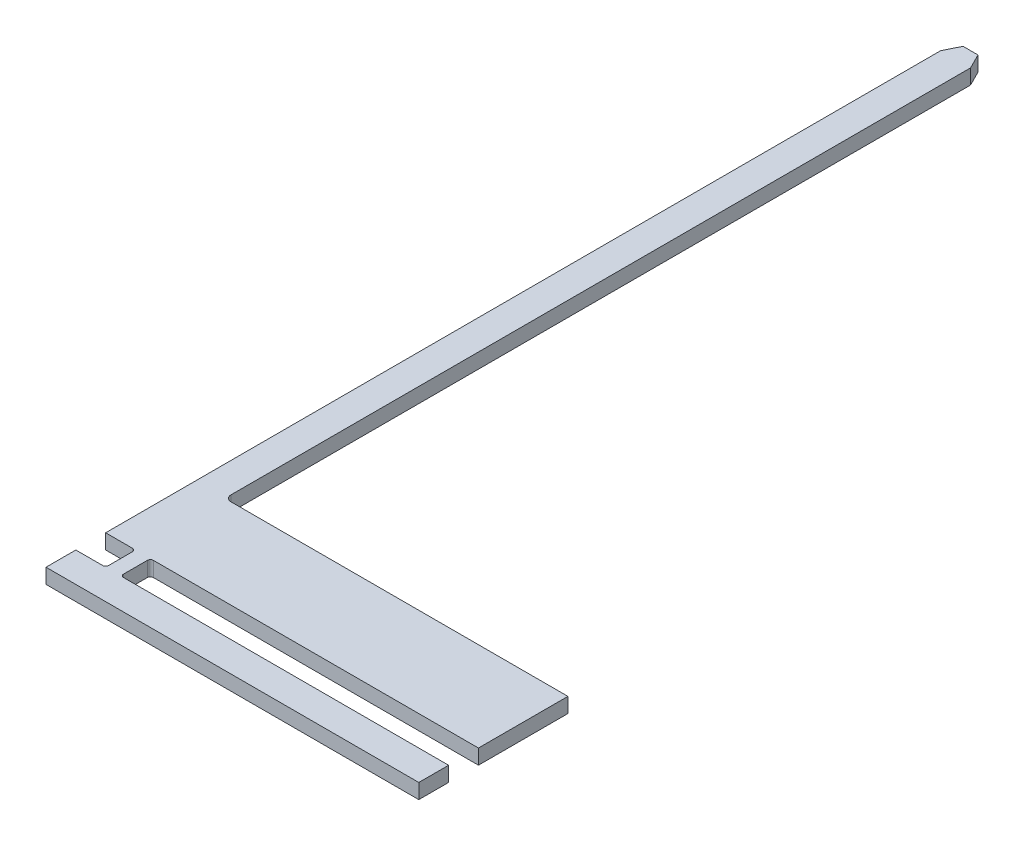
ISO-10303-21;
HEADER;
FILE_DESCRIPTION(('STEP AP214'),'2;1');
FILE_NAME('part.step','',(''),(''),'','','');
FILE_SCHEMA(('AUTOMOTIVE_DESIGN { 1 0 10303 214 1 1 1 1 }'));
ENDSEC;
DATA;
#1=APPLICATION_CONTEXT('core data for automotive mechanical design processes');
#2=APPLICATION_PROTOCOL_DEFINITION('international standard','automotive_design',2000,#1);
#3=PRODUCT_CONTEXT('',#1,'mechanical');
#4=PRODUCT('Part','Part','',(#3));
#5=PRODUCT_RELATED_PRODUCT_CATEGORY('part','',(#4));
#6=PRODUCT_DEFINITION_FORMATION('','',#4);
#7=PRODUCT_DEFINITION_CONTEXT('part definition',#1,'design');
#8=PRODUCT_DEFINITION('design','',#6,#7);
#9=PRODUCT_DEFINITION_SHAPE('','',#8);
#10=(LENGTH_UNIT() NAMED_UNIT(*) SI_UNIT(.MILLI.,.METRE.));
#11=(NAMED_UNIT(*) PLANE_ANGLE_UNIT() SI_UNIT($,.RADIAN.));
#12=(NAMED_UNIT(*) SI_UNIT($,.STERADIAN.) SOLID_ANGLE_UNIT());
#13=UNCERTAINTY_MEASURE_WITH_UNIT(LENGTH_MEASURE(1.E-05),#10,'distance_accuracy_value','');
#14=(GEOMETRIC_REPRESENTATION_CONTEXT(3) GLOBAL_UNCERTAINTY_ASSIGNED_CONTEXT((#13)) GLOBAL_UNIT_ASSIGNED_CONTEXT((#10,
#11,#12)) REPRESENTATION_CONTEXT('',''));
#15=CARTESIAN_POINT('',(0.,0.,0.));
#16=DIRECTION('',(0.,0.,1.));
#17=DIRECTION('',(1.,0.,0.));
#18=AXIS2_PLACEMENT_3D('',#15,#16,#17);
#19=CARTESIAN_POINT('',(0.0547920810387309,0.01,0.125212903225808));
#20=DIRECTION('',(-1.,0.,0.));
#21=DIRECTION('',(0.,0.,1.));
#22=AXIS2_PLACEMENT_3D('',#19,#20,#21);
#23=PLANE('',#22);
#24=DIRECTION('',(0.,0.,-1.));
#25=VECTOR('',#24,1.);
#26=CARTESIAN_POINT('',(0.0547920810387309,0.,0.125212903225808));
#27=LINE('',#26,#25);
#28=CARTESIAN_POINT('',(0.0547920810387309,0.,0.145212903225808));
#29=VERTEX_POINT('',#28);
#30=CARTESIAN_POINT('',(0.0547920810387309,0.,0.125212903225808));
#31=VERTEX_POINT('',#30);
#32=EDGE_CURVE('E230',#29,#31,#27,.T.);
#33=ORIENTED_EDGE('',*,*,#32,.T.);
#34=DIRECTION('',(0.,-1.,0.));
#35=VECTOR('',#34,1.);
#36=CARTESIAN_POINT('',(0.0547920810387309,0.01,0.125212903225808));
#37=LINE('',#36,#35);
#38=CARTESIAN_POINT('',(0.0547920810387309,0.01,0.125212903225808));
#39=VERTEX_POINT('',#38);
#40=EDGE_CURVE('E13',#39,#31,#37,.T.);
#41=ORIENTED_EDGE('',*,*,#40,.F.);
#42=DIRECTION('',(0.,0.,-1.));
#43=VECTOR('',#42,1.);
#44=CARTESIAN_POINT('',(0.0547920810387309,0.01,0.125212903225808));
#45=LINE('',#44,#43);
#46=CARTESIAN_POINT('',(0.0547920810387309,0.01,0.145212903225808));
#47=VERTEX_POINT('',#46);
#48=EDGE_CURVE('E292',#47,#39,#45,.T.);
#49=ORIENTED_EDGE('',*,*,#48,.F.);
#50=DIRECTION('',(0.,-1.,0.));
#51=VECTOR('',#50,1.);
#52=CARTESIAN_POINT('',(0.0547920810387309,0.01,0.145212903225808));
#53=LINE('',#52,#51);
#54=EDGE_CURVE('E226',#47,#29,#53,.T.);
#55=ORIENTED_EDGE('',*,*,#54,.T.);
#56=EDGE_LOOP('',(#33,#41,#49,#55));
#57=FACE_BOUND('',#56,.T.);
#58=ADVANCED_FACE('F51',(#57),#23,.F.);
#59=CARTESIAN_POINT('',(0.0547920810387309,0.01,0.125212903225808));
#60=DIRECTION('',(0.,0.,1.));
#61=DIRECTION('',(1.,0.,0.));
#62=AXIS2_PLACEMENT_3D('',#59,#60,#61);
#63=PLANE('',#62);
#64=DIRECTION('',(-1.,0.,0.));
#65=VECTOR('',#64,1.);
#66=CARTESIAN_POINT('',(0.0547920810387309,0.,0.125212903225808));
#67=LINE('',#66,#65);
#68=CARTESIAN_POINT('',(-0.163207918961269,0.,0.125212903225808));
#69=VERTEX_POINT('',#68);
#70=EDGE_CURVE('E234',#31,#69,#67,.T.);
#71=ORIENTED_EDGE('',*,*,#70,.T.);
#72=DIRECTION('',(0.,-1.,0.));
#73=VECTOR('',#72,1.);
#74=CARTESIAN_POINT('',(-0.163207918961269,0.01,0.125212903225808));
#75=LINE('',#74,#73);
#76=CARTESIAN_POINT('',(-0.163207918961269,0.01,0.125212903225808));
#77=VERTEX_POINT('',#76);
#78=EDGE_CURVE('E60',#77,#69,#75,.T.);
#79=ORIENTED_EDGE('',*,*,#78,.F.);
#80=DIRECTION('',(-1.,0.,0.));
#81=VECTOR('',#80,1.);
#82=CARTESIAN_POINT('',(0.0547920810387309,0.01,0.125212903225808));
#83=LINE('',#82,#81);
#84=EDGE_CURVE('E150',#39,#77,#83,.T.);
#85=ORIENTED_EDGE('',*,*,#84,.F.);
#86=ORIENTED_EDGE('',*,*,#40,.T.);
#87=EDGE_LOOP('',(#71,#79,#85,#86));
#88=FACE_BOUND('',#87,.T.);
#89=ADVANCED_FACE('F449',(#88),#63,.F.);
#90=CARTESIAN_POINT('',(-0.163207918961269,0.01,0.123212903225808));
#91=DIRECTION('',(0.,-1.,0.));
#92=DIRECTION('',(0.,0.,-1.));
#93=AXIS2_PLACEMENT_3D('',#90,#91,#92);
#94=CYLINDRICAL_SURFACE('',#93,0.00199999999999999);
#95=CARTESIAN_POINT('',(-0.163207918961269,0.,0.123212903225808));
#96=DIRECTION('',(0.,-1.,0.));
#97=DIRECTION('',(0.,0.,-1.));
#98=AXIS2_PLACEMENT_3D('',#95,#96,#97);
#99=CIRCLE('',#98,0.00199999999999999);
#100=CARTESIAN_POINT('',(-0.165207918961269,0.,0.123212903225808));
#101=VERTEX_POINT('',#100);
#102=EDGE_CURVE('E237',#69,#101,#99,.T.);
#103=ORIENTED_EDGE('',*,*,#102,.T.);
#104=DIRECTION('',(0.,-1.,0.));
#105=VECTOR('',#104,1.);
#106=CARTESIAN_POINT('',(-0.165207918961269,0.01,0.123212903225808));
#107=LINE('',#106,#105);
#108=CARTESIAN_POINT('',(-0.165207918961269,0.01,0.123212903225808));
#109=VERTEX_POINT('',#108);
#110=EDGE_CURVE('E355',#109,#101,#107,.T.);
#111=ORIENTED_EDGE('',*,*,#110,.F.);
#112=CARTESIAN_POINT('',(-0.163207918961269,0.01,0.123212903225808));
#113=DIRECTION('',(0.,-1.,0.));
#114=DIRECTION('',(0.,0.,-1.));
#115=AXIS2_PLACEMENT_3D('',#112,#113,#114);
#116=CIRCLE('',#115,0.00199999999999999);
#117=EDGE_CURVE('E365',#77,#109,#116,.T.);
#118=ORIENTED_EDGE('',*,*,#117,.F.);
#119=ORIENTED_EDGE('',*,*,#78,.T.);
#120=EDGE_LOOP('',(#103,#111,#118,#119));
#121=FACE_BOUND('',#120,.T.);
#122=ADVANCED_FACE('F363',(#121),#94,.F.);
#123=CARTESIAN_POINT('',(-0.165207918961269,0.01,0.123212903225808));
#124=DIRECTION('',(-1.,0.,0.));
#125=DIRECTION('',(0.,0.,1.));
#126=AXIS2_PLACEMENT_3D('',#123,#124,#125);
#127=PLANE('',#126);
#128=DIRECTION('',(0.,0.,-1.));
#129=VECTOR('',#128,1.);
#130=CARTESIAN_POINT('',(-0.165207918961269,0.,0.123212903225808));
#131=LINE('',#130,#129);
#132=CARTESIAN_POINT('',(-0.165207918961269,0.,0.107212903225808));
#133=VERTEX_POINT('',#132);
#134=EDGE_CURVE('E240',#101,#133,#131,.T.);
#135=ORIENTED_EDGE('',*,*,#134,.T.);
#136=DIRECTION('',(0.,-1.,0.));
#137=VECTOR('',#136,1.);
#138=CARTESIAN_POINT('',(-0.165207918961269,0.01,0.107212903225808));
#139=LINE('',#138,#137);
#140=CARTESIAN_POINT('',(-0.165207918961269,0.01,0.107212903225808));
#141=VERTEX_POINT('',#140);
#142=EDGE_CURVE('E351',#141,#133,#139,.T.);
#143=ORIENTED_EDGE('',*,*,#142,.F.);
#144=DIRECTION('',(0.,0.,-1.));
#145=VECTOR('',#144,1.);
#146=CARTESIAN_POINT('',(-0.165207918961269,0.01,0.123212903225808));
#147=LINE('',#146,#145);
#148=EDGE_CURVE('E384',#109,#141,#147,.T.);
#149=ORIENTED_EDGE('',*,*,#148,.F.);
#150=ORIENTED_EDGE('',*,*,#110,.T.);
#151=EDGE_LOOP('',(#135,#143,#149,#150));
#152=FACE_BOUND('',#151,.T.);
#153=ADVANCED_FACE('F374',(#152),#127,.F.);
#154=CARTESIAN_POINT('',(-0.163207918961269,0.01,0.107212903225808));
#155=DIRECTION('',(0.,-1.,0.));
#156=DIRECTION('',(0.,0.,-1.));
#157=AXIS2_PLACEMENT_3D('',#154,#155,#156);
#158=CYLINDRICAL_SURFACE('',#157,0.00199999999999999);
#159=CARTESIAN_POINT('',(-0.163207918961269,0.,0.107212903225808));
#160=DIRECTION('',(0.,-1.,0.));
#161=DIRECTION('',(0.,0.,1.));
#162=AXIS2_PLACEMENT_3D('',#159,#160,#161);
#163=CIRCLE('',#162,0.00199999999999999);
#164=CARTESIAN_POINT('',(-0.163207918961269,0.,0.105212903225808));
#165=VERTEX_POINT('',#164);
#166=EDGE_CURVE('E243',#133,#165,#163,.T.);
#167=ORIENTED_EDGE('',*,*,#166,.T.);
#168=DIRECTION('',(0.,-1.,0.));
#169=VECTOR('',#168,1.);
#170=CARTESIAN_POINT('',(-0.163207918961269,0.01,0.105212903225808));
#171=LINE('',#170,#169);
#172=CARTESIAN_POINT('',(-0.163207918961269,0.01,0.105212903225808));
#173=VERTEX_POINT('',#172);
#174=EDGE_CURVE('E347',#173,#165,#171,.T.);
#175=ORIENTED_EDGE('',*,*,#174,.F.);
#176=CARTESIAN_POINT('',(-0.163207918961269,0.01,0.107212903225808));
#177=DIRECTION('',(0.,-1.,0.));
#178=DIRECTION('',(0.,0.,1.));
#179=AXIS2_PLACEMENT_3D('',#176,#177,#178);
#180=CIRCLE('',#179,0.00199999999999999);
#181=EDGE_CURVE('E380',#141,#173,#180,.T.);
#182=ORIENTED_EDGE('',*,*,#181,.F.);
#183=ORIENTED_EDGE('',*,*,#142,.T.);
#184=EDGE_LOOP('',(#167,#175,#182,#183));
#185=FACE_BOUND('',#184,.T.);
#186=ADVANCED_FACE('F378',(#185),#158,.F.);
#187=CARTESIAN_POINT('',(-0.163207918961269,0.01,0.105212903225808));
#188=DIRECTION('',(0.,0.,-1.));
#189=DIRECTION('',(-1.,0.,0.));
#190=AXIS2_PLACEMENT_3D('',#187,#188,#189);
#191=PLANE('',#190);
#192=DIRECTION('',(1.,0.,0.));
#193=VECTOR('',#192,1.);
#194=CARTESIAN_POINT('',(-0.163207918961269,0.,0.105212903225808));
#195=LINE('',#194,#193);
#196=CARTESIAN_POINT('',(0.0547920810387309,0.,0.105212903225808));
#197=VERTEX_POINT('',#196);
#198=EDGE_CURVE('E246',#165,#197,#195,.T.);
#199=ORIENTED_EDGE('',*,*,#198,.T.);
#200=DIRECTION('',(0.,-1.,0.));
#201=VECTOR('',#200,1.);
#202=CARTESIAN_POINT('',(0.0547920810387309,0.01,0.105212903225808));
#203=LINE('',#202,#201);
#204=CARTESIAN_POINT('',(0.0547920810387309,0.01,0.105212903225808));
#205=VERTEX_POINT('',#204);
#206=EDGE_CURVE('E343',#205,#197,#203,.T.);
#207=ORIENTED_EDGE('',*,*,#206,.F.);
#208=DIRECTION('',(1.,0.,0.));
#209=VECTOR('',#208,1.);
#210=CARTESIAN_POINT('',(-0.163207918961269,0.01,0.105212903225808));
#211=LINE('',#210,#209);
#212=EDGE_CURVE('E383',#173,#205,#211,.T.);
#213=ORIENTED_EDGE('',*,*,#212,.F.);
#214=ORIENTED_EDGE('',*,*,#174,.T.);
#215=EDGE_LOOP('',(#199,#207,#213,#214));
#216=FACE_BOUND('',#215,.T.);
#217=ADVANCED_FACE('F462',(#216),#191,.F.);
#218=CARTESIAN_POINT('',(0.0547920810387309,0.01,0.0452129032258077));
#219=DIRECTION('',(-1.,0.,0.));
#220=DIRECTION('',(0.,0.,1.));
#221=AXIS2_PLACEMENT_3D('',#218,#219,#220);
#222=PLANE('',#221);
#223=DIRECTION('',(0.,0.,-1.));
#224=VECTOR('',#223,1.);
#225=CARTESIAN_POINT('',(0.0547920810387309,0.,0.0452129032258077));
#226=LINE('',#225,#224);
#227=CARTESIAN_POINT('',(0.0547920810387309,0.,0.0452129032258077));
#228=VERTEX_POINT('',#227);
#229=EDGE_CURVE('E249',#197,#228,#226,.T.);
#230=ORIENTED_EDGE('',*,*,#229,.T.);
#231=DIRECTION('',(0.,-1.,0.));
#232=VECTOR('',#231,1.);
#233=CARTESIAN_POINT('',(0.0547920810387309,0.01,0.0452129032258077));
#234=LINE('',#233,#232);
#235=CARTESIAN_POINT('',(0.0547920810387309,0.01,0.0452129032258077));
#236=VERTEX_POINT('',#235);
#237=EDGE_CURVE('E339',#236,#228,#234,.T.);
#238=ORIENTED_EDGE('',*,*,#237,.F.);
#239=DIRECTION('',(0.,0.,-1.));
#240=VECTOR('',#239,1.);
#241=CARTESIAN_POINT('',(0.0547920810387309,0.01,0.0452129032258077));
#242=LINE('',#241,#240);
#243=EDGE_CURVE('E388',#205,#236,#242,.T.);
#244=ORIENTED_EDGE('',*,*,#243,.F.);
#245=ORIENTED_EDGE('',*,*,#206,.T.);
#246=EDGE_LOOP('',(#230,#238,#244,#245));
#247=FACE_BOUND('',#246,.T.);
#248=ADVANCED_FACE('F465',(#247),#222,.F.);
#249=CARTESIAN_POINT('',(-0.171207918961269,0.01,0.0452129032258077));
#250=DIRECTION('',(0.,0.,1.));
#251=DIRECTION('',(1.,0.,0.));
#252=AXIS2_PLACEMENT_3D('',#249,#250,#251);
#253=PLANE('',#252);
#254=DIRECTION('',(-1.,0.,0.));
#255=VECTOR('',#254,1.);
#256=CARTESIAN_POINT('',(-0.171207918961269,0.,0.0452129032258077));
#257=LINE('',#256,#255);
#258=CARTESIAN_POINT('',(-0.171207918961269,0.,0.0452129032258077));
#259=VERTEX_POINT('',#258);
#260=EDGE_CURVE('E252',#228,#259,#257,.T.);
#261=ORIENTED_EDGE('',*,*,#260,.T.);
#262=DIRECTION('',(0.,-1.,0.));
#263=VECTOR('',#262,1.);
#264=CARTESIAN_POINT('',(-0.171207918961269,0.01,0.0452129032258077));
#265=LINE('',#264,#263);
#266=CARTESIAN_POINT('',(-0.171207918961269,0.01,0.0452129032258077));
#267=VERTEX_POINT('',#266);
#268=EDGE_CURVE('E335',#267,#259,#265,.T.);
#269=ORIENTED_EDGE('',*,*,#268,.F.);
#270=DIRECTION('',(-1.,0.,0.));
#271=VECTOR('',#270,1.);
#272=CARTESIAN_POINT('',(-0.171207918961269,0.01,0.0452129032258077));
#273=LINE('',#272,#271);
#274=EDGE_CURVE('E395',#236,#267,#273,.T.);
#275=ORIENTED_EDGE('',*,*,#274,.F.);
#276=ORIENTED_EDGE('',*,*,#237,.T.);
#277=EDGE_LOOP('',(#261,#269,#275,#276));
#278=FACE_BOUND('',#277,.T.);
#279=ADVANCED_FACE('F469',(#278),#253,.F.);
#280=CARTESIAN_POINT('',(-0.171207918961269,0.01,0.0412129032258077));
#281=DIRECTION('',(0.,-1.,0.));
#282=DIRECTION('',(0.,0.,-1.));
#283=AXIS2_PLACEMENT_3D('',#280,#281,#282);
#284=CYLINDRICAL_SURFACE('',#283,0.004);
#285=CARTESIAN_POINT('',(-0.171207918961269,0.,0.0412129032258077));
#286=DIRECTION('',(0.,-1.,0.));
#287=DIRECTION('',(0.,0.,-1.));
#288=AXIS2_PLACEMENT_3D('',#285,#286,#287);
#289=CIRCLE('',#288,0.004);
#290=CARTESIAN_POINT('',(-0.175207918961269,0.,0.0412129032258077));
#291=VERTEX_POINT('',#290);
#292=EDGE_CURVE('E255',#259,#291,#289,.T.);
#293=ORIENTED_EDGE('',*,*,#292,.T.);
#294=DIRECTION('',(0.,-1.,0.));
#295=VECTOR('',#294,1.);
#296=CARTESIAN_POINT('',(-0.175207918961269,0.01,0.0412129032258077));
#297=LINE('',#296,#295);
#298=CARTESIAN_POINT('',(-0.175207918961269,0.01,0.0412129032258077));
#299=VERTEX_POINT('',#298);
#300=EDGE_CURVE('E331',#299,#291,#297,.T.);
#301=ORIENTED_EDGE('',*,*,#300,.F.);
#302=CARTESIAN_POINT('',(-0.171207918961269,0.01,0.0412129032258077));
#303=DIRECTION('',(0.,-1.,0.));
#304=DIRECTION('',(0.,0.,-1.));
#305=AXIS2_PLACEMENT_3D('',#302,#303,#304);
#306=CIRCLE('',#305,0.004);
#307=EDGE_CURVE('E398',#267,#299,#306,.T.);
#308=ORIENTED_EDGE('',*,*,#307,.F.);
#309=ORIENTED_EDGE('',*,*,#268,.T.);
#310=EDGE_LOOP('',(#293,#301,#308,#309));
#311=FACE_BOUND('',#310,.T.);
#312=ADVANCED_FACE('F473',(#311),#284,.F.);
#313=CARTESIAN_POINT('',(-0.175207918961269,0.01,0.0412129032258077));
#314=DIRECTION('',(-1.,0.,0.));
#315=DIRECTION('',(0.,0.,1.));
#316=AXIS2_PLACEMENT_3D('',#313,#314,#315);
#317=PLANE('',#316);
#318=DIRECTION('',(0.,0.,-1.));
#319=VECTOR('',#318,1.);
#320=CARTESIAN_POINT('',(-0.175207918961269,0.,0.0412129032258077));
#321=LINE('',#320,#319);
#322=CARTESIAN_POINT('',(-0.175207918961269,0.,-0.454787096774192));
#323=VERTEX_POINT('',#322);
#324=EDGE_CURVE('E258',#291,#323,#321,.T.);
#325=ORIENTED_EDGE('',*,*,#324,.T.);
#326=DIRECTION('',(0.,-1.,0.));
#327=VECTOR('',#326,1.);
#328=CARTESIAN_POINT('',(-0.175207918961269,0.01,-0.454787096774192));
#329=LINE('',#328,#327);
#330=CARTESIAN_POINT('',(-0.175207918961269,0.01,-0.454787096774192));
#331=VERTEX_POINT('',#330);
#332=EDGE_CURVE('E327',#331,#323,#329,.T.);
#333=ORIENTED_EDGE('',*,*,#332,.F.);
#334=DIRECTION('',(0.,0.,-1.));
#335=VECTOR('',#334,1.);
#336=CARTESIAN_POINT('',(-0.175207918961269,0.01,0.0412129032258077));
#337=LINE('',#336,#335);
#338=EDGE_CURVE('E401',#299,#331,#337,.T.);
#339=ORIENTED_EDGE('',*,*,#338,.F.);
#340=ORIENTED_EDGE('',*,*,#300,.T.);
#341=EDGE_LOOP('',(#325,#333,#339,#340));
#342=FACE_BOUND('',#341,.T.);
#343=ADVANCED_FACE('F477',(#342),#317,.F.);
#344=CARTESIAN_POINT('',(-0.175207918961269,0.01,-0.454787096774192));
#345=DIRECTION('',(-0.894427190999915,0.,0.44721359549996));
#346=DIRECTION('',(0.44721359549996,0.,0.894427190999915));
#347=AXIS2_PLACEMENT_3D('',#344,#345,#346);
#348=PLANE('',#347);
#349=DIRECTION('',(-0.44721359549996,0.,-0.894427190999915));
#350=VECTOR('',#349,1.);
#351=CARTESIAN_POINT('',(-0.175207918961269,0.,-0.454787096774192));
#352=LINE('',#351,#350);
#353=CARTESIAN_POINT('',(-0.180207918961269,0.,-0.464787096774192));
#354=VERTEX_POINT('',#353);
#355=EDGE_CURVE('E261',#323,#354,#352,.T.);
#356=ORIENTED_EDGE('',*,*,#355,.T.);
#357=DIRECTION('',(0.,-1.,0.));
#358=VECTOR('',#357,1.);
#359=CARTESIAN_POINT('',(-0.180207918961269,0.01,-0.464787096774192));
#360=LINE('',#359,#358);
#361=CARTESIAN_POINT('',(-0.180207918961269,0.01,-0.464787096774192));
#362=VERTEX_POINT('',#361);
#363=EDGE_CURVE('E323',#362,#354,#360,.T.);
#364=ORIENTED_EDGE('',*,*,#363,.F.);
#365=DIRECTION('',(-0.44721359549996,0.,-0.894427190999915));
#366=VECTOR('',#365,1.);
#367=CARTESIAN_POINT('',(-0.175207918961269,0.01,-0.454787096774192));
#368=LINE('',#367,#366);
#369=EDGE_CURVE('E404',#331,#362,#368,.T.);
#370=ORIENTED_EDGE('',*,*,#369,.F.);
#371=ORIENTED_EDGE('',*,*,#332,.T.);
#372=EDGE_LOOP('',(#356,#364,#370,#371));
#373=FACE_BOUND('',#372,.T.);
#374=ADVANCED_FACE('F481',(#373),#348,.F.);
#375=CARTESIAN_POINT('',(-0.180207918961269,0.01,-0.464787096774192));
#376=DIRECTION('',(0.,0.,1.));
#377=DIRECTION('',(1.,0.,0.));
#378=AXIS2_PLACEMENT_3D('',#375,#376,#377);
#379=PLANE('',#378);
#380=DIRECTION('',(-1.,0.,0.));
#381=VECTOR('',#380,1.);
#382=CARTESIAN_POINT('',(-0.180207918961269,0.,-0.464787096774192));
#383=LINE('',#382,#381);
#384=CARTESIAN_POINT('',(-0.190207918961269,0.,-0.464787096774192));
#385=VERTEX_POINT('',#384);
#386=EDGE_CURVE('E264',#354,#385,#383,.T.);
#387=ORIENTED_EDGE('',*,*,#386,.T.);
#388=DIRECTION('',(0.,-1.,0.));
#389=VECTOR('',#388,1.);
#390=CARTESIAN_POINT('',(-0.190207918961269,0.01,-0.464787096774192));
#391=LINE('',#390,#389);
#392=CARTESIAN_POINT('',(-0.190207918961269,0.01,-0.464787096774192));
#393=VERTEX_POINT('',#392);
#394=EDGE_CURVE('E319',#393,#385,#391,.T.);
#395=ORIENTED_EDGE('',*,*,#394,.F.);
#396=DIRECTION('',(-1.,0.,0.));
#397=VECTOR('',#396,1.);
#398=CARTESIAN_POINT('',(-0.180207918961269,0.01,-0.464787096774192));
#399=LINE('',#398,#397);
#400=EDGE_CURVE('E407',#362,#393,#399,.T.);
#401=ORIENTED_EDGE('',*,*,#400,.F.);
#402=ORIENTED_EDGE('',*,*,#363,.T.);
#403=EDGE_LOOP('',(#387,#395,#401,#402));
#404=FACE_BOUND('',#403,.T.);
#405=ADVANCED_FACE('F485',(#404),#379,.F.);
#406=CARTESIAN_POINT('',(-0.190207918961269,0.01,-0.464787096774192));
#407=DIRECTION('',(0.894427190999916,0.,0.447213595499958));
#408=DIRECTION('',(0.447213595499958,0.,-0.894427190999916));
#409=AXIS2_PLACEMENT_3D('',#406,#407,#408);
#410=PLANE('',#409);
#411=DIRECTION('',(-0.447213595499958,0.,0.894427190999916));
#412=VECTOR('',#411,1.);
#413=CARTESIAN_POINT('',(-0.190207918961269,0.,-0.464787096774192));
#414=LINE('',#413,#412);
#415=CARTESIAN_POINT('',(-0.195207918961269,0.,-0.454787096774192));
#416=VERTEX_POINT('',#415);
#417=EDGE_CURVE('E267',#385,#416,#414,.T.);
#418=ORIENTED_EDGE('',*,*,#417,.T.);
#419=DIRECTION('',(0.,-1.,0.));
#420=VECTOR('',#419,1.);
#421=CARTESIAN_POINT('',(-0.195207918961269,0.01,-0.454787096774192));
#422=LINE('',#421,#420);
#423=CARTESIAN_POINT('',(-0.195207918961269,0.01,-0.454787096774192));
#424=VERTEX_POINT('',#423);
#425=EDGE_CURVE('E315',#424,#416,#422,.T.);
#426=ORIENTED_EDGE('',*,*,#425,.F.);
#427=DIRECTION('',(-0.447213595499958,0.,0.894427190999916));
#428=VECTOR('',#427,1.);
#429=CARTESIAN_POINT('',(-0.190207918961269,0.01,-0.464787096774192));
#430=LINE('',#429,#428);
#431=EDGE_CURVE('E410',#393,#424,#430,.T.);
#432=ORIENTED_EDGE('',*,*,#431,.F.);
#433=ORIENTED_EDGE('',*,*,#394,.T.);
#434=EDGE_LOOP('',(#418,#426,#432,#433));
#435=FACE_BOUND('',#434,.T.);
#436=ADVANCED_FACE('F489',(#435),#410,.F.);
#437=CARTESIAN_POINT('',(-0.195207918961269,0.01,0.0652129032258077));
#438=DIRECTION('',(1.,0.,0.));
#439=DIRECTION('',(0.,0.,-1.));
#440=AXIS2_PLACEMENT_3D('',#437,#438,#439);
#441=PLANE('',#440);
#442=DIRECTION('',(0.,0.,1.));
#443=VECTOR('',#442,1.);
#444=CARTESIAN_POINT('',(-0.195207918961269,0.,0.0652129032258077));
#445=LINE('',#444,#443);
#446=CARTESIAN_POINT('',(-0.195207918961269,0.,0.105212903225808));
#447=VERTEX_POINT('',#446);
#448=EDGE_CURVE('E271',#416,#447,#445,.T.);
#449=ORIENTED_EDGE('',*,*,#448,.T.);
#450=DIRECTION('',(0.,-1.,0.));
#451=VECTOR('',#450,1.);
#452=CARTESIAN_POINT('',(-0.195207918961269,0.01,0.105212903225808));
#453=LINE('',#452,#451);
#454=CARTESIAN_POINT('',(-0.195207918961269,0.01,0.105212903225808));
#455=VERTEX_POINT('',#454);
#456=EDGE_CURVE('E311',#455,#447,#453,.T.);
#457=ORIENTED_EDGE('',*,*,#456,.F.);
#458=DIRECTION('',(0.,0.,1.));
#459=VECTOR('',#458,1.);
#460=CARTESIAN_POINT('',(-0.195207918961269,0.01,0.0652129032258077));
#461=LINE('',#460,#459);
#462=EDGE_CURVE('E413',#424,#455,#461,.T.);
#463=ORIENTED_EDGE('',*,*,#462,.F.);
#464=ORIENTED_EDGE('',*,*,#425,.T.);
#465=EDGE_LOOP('',(#449,#457,#463,#464));
#466=FACE_BOUND('',#465,.T.);
#467=ADVANCED_FACE('F493',(#466),#441,.F.);
#468=CARTESIAN_POINT('',(-0.195207918961269,0.01,0.105212903225808));
#469=DIRECTION('',(0.,0.,-1.));
#470=DIRECTION('',(-1.,0.,0.));
#471=AXIS2_PLACEMENT_3D('',#468,#469,#470);
#472=PLANE('',#471);
#473=DIRECTION('',(1.,0.,0.));
#474=VECTOR('',#473,1.);
#475=CARTESIAN_POINT('',(-0.195207918961269,0.,0.105212903225808));
#476=LINE('',#475,#474);
#477=CARTESIAN_POINT('',(-0.177207918961269,0.,0.105212903225808));
#478=VERTEX_POINT('',#477);
#479=EDGE_CURVE('E274',#447,#478,#476,.T.);
#480=ORIENTED_EDGE('',*,*,#479,.T.);
#481=DIRECTION('',(0.,-1.,0.));
#482=VECTOR('',#481,1.);
#483=CARTESIAN_POINT('',(-0.177207918961269,0.01,0.105212903225808));
#484=LINE('',#483,#482);
#485=CARTESIAN_POINT('',(-0.177207918961269,0.01,0.105212903225808));
#486=VERTEX_POINT('',#485);
#487=EDGE_CURVE('E307',#486,#478,#484,.T.);
#488=ORIENTED_EDGE('',*,*,#487,.F.);
#489=DIRECTION('',(1.,0.,0.));
#490=VECTOR('',#489,1.);
#491=CARTESIAN_POINT('',(-0.195207918961269,0.01,0.105212903225808));
#492=LINE('',#491,#490);
#493=EDGE_CURVE('E416',#455,#486,#492,.T.);
#494=ORIENTED_EDGE('',*,*,#493,.F.);
#495=ORIENTED_EDGE('',*,*,#456,.T.);
#496=EDGE_LOOP('',(#480,#488,#494,#495));
#497=FACE_BOUND('',#496,.T.);
#498=ADVANCED_FACE('F497',(#497),#472,.F.);
#499=CARTESIAN_POINT('',(-0.177207918961269,0.01,0.107212903225808));
#500=DIRECTION('',(0.,-1.,0.));
#501=DIRECTION('',(0.,0.,-1.));
#502=AXIS2_PLACEMENT_3D('',#499,#500,#501);
#503=CYLINDRICAL_SURFACE('',#502,0.00199999999999999);
#504=CARTESIAN_POINT('',(-0.177207918961269,0.,0.107212903225808));
#505=DIRECTION('',(0.,-1.,0.));
#506=DIRECTION('',(0.,0.,-1.));
#507=AXIS2_PLACEMENT_3D('',#504,#505,#506);
#508=CIRCLE('',#507,0.00199999999999999);
#509=CARTESIAN_POINT('',(-0.175207918961269,0.,0.107212903225808));
#510=VERTEX_POINT('',#509);
#511=EDGE_CURVE('E277',#478,#510,#508,.T.);
#512=ORIENTED_EDGE('',*,*,#511,.T.);
#513=DIRECTION('',(0.,-1.,0.));
#514=VECTOR('',#513,1.);
#515=CARTESIAN_POINT('',(-0.175207918961269,0.01,0.107212903225808));
#516=LINE('',#515,#514);
#517=CARTESIAN_POINT('',(-0.175207918961269,0.01,0.107212903225808));
#518=VERTEX_POINT('',#517);
#519=EDGE_CURVE('E303',#518,#510,#516,.T.);
#520=ORIENTED_EDGE('',*,*,#519,.F.);
#521=CARTESIAN_POINT('',(-0.177207918961269,0.01,0.107212903225808));
#522=DIRECTION('',(0.,-1.,0.));
#523=DIRECTION('',(0.,0.,-1.));
#524=AXIS2_PLACEMENT_3D('',#521,#522,#523);
#525=CIRCLE('',#524,0.00199999999999999);
#526=EDGE_CURVE('E419',#486,#518,#525,.T.);
#527=ORIENTED_EDGE('',*,*,#526,.F.);
#528=ORIENTED_EDGE('',*,*,#487,.T.);
#529=EDGE_LOOP('',(#512,#520,#527,#528));
#530=FACE_BOUND('',#529,.T.);
#531=ADVANCED_FACE('F501',(#530),#503,.F.);
#532=CARTESIAN_POINT('',(-0.175207918961269,0.01,0.123212903225808));
#533=DIRECTION('',(1.,0.,0.));
#534=DIRECTION('',(0.,0.,-1.));
#535=AXIS2_PLACEMENT_3D('',#532,#533,#534);
#536=PLANE('',#535);
#537=DIRECTION('',(0.,0.,1.));
#538=VECTOR('',#537,1.);
#539=CARTESIAN_POINT('',(-0.175207918961269,0.,0.123212903225808));
#540=LINE('',#539,#538);
#541=CARTESIAN_POINT('',(-0.175207918961269,0.,0.123212903225808));
#542=VERTEX_POINT('',#541);
#543=EDGE_CURVE('E280',#510,#542,#540,.T.);
#544=ORIENTED_EDGE('',*,*,#543,.T.);
#545=DIRECTION('',(0.,-1.,0.));
#546=VECTOR('',#545,1.);
#547=CARTESIAN_POINT('',(-0.175207918961269,0.01,0.123212903225808));
#548=LINE('',#547,#546);
#549=CARTESIAN_POINT('',(-0.175207918961269,0.01,0.123212903225808));
#550=VERTEX_POINT('',#549);
#551=EDGE_CURVE('E299',#550,#542,#548,.T.);
#552=ORIENTED_EDGE('',*,*,#551,.F.);
#553=DIRECTION('',(0.,0.,1.));
#554=VECTOR('',#553,1.);
#555=CARTESIAN_POINT('',(-0.175207918961269,0.01,0.123212903225808));
#556=LINE('',#555,#554);
#557=EDGE_CURVE('E422',#518,#550,#556,.T.);
#558=ORIENTED_EDGE('',*,*,#557,.F.);
#559=ORIENTED_EDGE('',*,*,#519,.T.);
#560=EDGE_LOOP('',(#544,#552,#558,#559));
#561=FACE_BOUND('',#560,.T.);
#562=ADVANCED_FACE('F430',(#561),#536,.F.);
#563=CARTESIAN_POINT('',(-0.177207918961269,0.01,0.123212903225808));
#564=DIRECTION('',(0.,-1.,0.));
#565=DIRECTION('',(0.,0.,-1.));
#566=AXIS2_PLACEMENT_3D('',#563,#564,#565);
#567=CYLINDRICAL_SURFACE('',#566,0.00199999999999999);
#568=CARTESIAN_POINT('',(-0.177207918961269,0.,0.123212903225808));
#569=DIRECTION('',(0.,-1.,0.));
#570=DIRECTION('',(0.,0.,1.));
#571=AXIS2_PLACEMENT_3D('',#568,#569,#570);
#572=CIRCLE('',#571,0.00199999999999999);
#573=CARTESIAN_POINT('',(-0.177207918961269,0.,0.125212903225808));
#574=VERTEX_POINT('',#573);
#575=EDGE_CURVE('E283',#542,#574,#572,.T.);
#576=ORIENTED_EDGE('',*,*,#575,.T.);
#577=DIRECTION('',(0.,-1.,0.));
#578=VECTOR('',#577,1.);
#579=CARTESIAN_POINT('',(-0.177207918961269,0.01,0.125212903225808));
#580=LINE('',#579,#578);
#581=CARTESIAN_POINT('',(-0.177207918961269,0.01,0.125212903225808));
#582=VERTEX_POINT('',#581);
#583=EDGE_CURVE('E219',#582,#574,#580,.T.);
#584=ORIENTED_EDGE('',*,*,#583,.F.);
#585=CARTESIAN_POINT('',(-0.177207918961269,0.01,0.123212903225808));
#586=DIRECTION('',(0.,-1.,0.));
#587=DIRECTION('',(0.,0.,1.));
#588=AXIS2_PLACEMENT_3D('',#585,#586,#587);
#589=CIRCLE('',#588,0.00199999999999999);
#590=EDGE_CURVE('E208',#550,#582,#589,.T.);
#591=ORIENTED_EDGE('',*,*,#590,.F.);
#592=ORIENTED_EDGE('',*,*,#551,.T.);
#593=EDGE_LOOP('',(#576,#584,#591,#592));
#594=FACE_BOUND('',#593,.T.);
#595=ADVANCED_FACE('F434',(#594),#567,.F.);
#596=CARTESIAN_POINT('',(-0.177207918961269,0.01,0.125212903225808));
#597=DIRECTION('',(0.,0.,1.));
#598=DIRECTION('',(1.,0.,0.));
#599=AXIS2_PLACEMENT_3D('',#596,#597,#598);
#600=PLANE('',#599);
#601=DIRECTION('',(-1.,0.,0.));
#602=VECTOR('',#601,1.);
#603=CARTESIAN_POINT('',(-0.177207918961269,0.,0.125212903225808));
#604=LINE('',#603,#602);
#605=CARTESIAN_POINT('',(-0.195207918961269,0.,0.125212903225808));
#606=VERTEX_POINT('',#605);
#607=EDGE_CURVE('E217',#574,#606,#604,.T.);
#608=ORIENTED_EDGE('',*,*,#607,.T.);
#609=DIRECTION('',(0.,-1.,0.));
#610=VECTOR('',#609,1.);
#611=CARTESIAN_POINT('',(-0.195207918961269,0.01,0.125212903225808));
#612=LINE('',#611,#610);
#613=CARTESIAN_POINT('',(-0.195207918961269,0.01,0.125212903225808));
#614=VERTEX_POINT('',#613);
#615=EDGE_CURVE('E214',#614,#606,#612,.T.);
#616=ORIENTED_EDGE('',*,*,#615,.F.);
#617=DIRECTION('',(-1.,0.,0.));
#618=VECTOR('',#617,1.);
#619=CARTESIAN_POINT('',(-0.177207918961269,0.01,0.125212903225808));
#620=LINE('',#619,#618);
#621=EDGE_CURVE('E202',#582,#614,#620,.T.);
#622=ORIENTED_EDGE('',*,*,#621,.F.);
#623=ORIENTED_EDGE('',*,*,#583,.T.);
#624=EDGE_LOOP('',(#608,#616,#622,#623));
#625=FACE_BOUND('',#624,.T.);
#626=ADVANCED_FACE('F215',(#625),#600,.F.);
#627=CARTESIAN_POINT('',(-0.195207918961269,0.01,0.125212903225808));
#628=DIRECTION('',(1.,0.,0.));
#629=DIRECTION('',(0.,0.,-1.));
#630=AXIS2_PLACEMENT_3D('',#627,#628,#629);
#631=PLANE('',#630);
#632=DIRECTION('',(0.,0.,1.));
#633=VECTOR('',#632,1.);
#634=CARTESIAN_POINT('',(-0.195207918961269,0.,0.125212903225808));
#635=LINE('',#634,#633);
#636=CARTESIAN_POINT('',(-0.195207918961269,0.,0.145212903225808));
#637=VERTEX_POINT('',#636);
#638=EDGE_CURVE('E136',#606,#637,#635,.T.);
#639=ORIENTED_EDGE('',*,*,#638,.T.);
#640=DIRECTION('',(0.,-1.,0.));
#641=VECTOR('',#640,1.);
#642=CARTESIAN_POINT('',(-0.195207918961269,0.01,0.145212903225808));
#643=LINE('',#642,#641);
#644=CARTESIAN_POINT('',(-0.195207918961269,0.01,0.145212903225808));
#645=VERTEX_POINT('',#644);
#646=EDGE_CURVE('E220',#645,#637,#643,.T.);
#647=ORIENTED_EDGE('',*,*,#646,.F.);
#648=DIRECTION('',(0.,0.,1.));
#649=VECTOR('',#648,1.);
#650=CARTESIAN_POINT('',(-0.195207918961269,0.01,0.125212903225808));
#651=LINE('',#650,#649);
#652=EDGE_CURVE('E206',#614,#645,#651,.T.);
#653=ORIENTED_EDGE('',*,*,#652,.F.);
#654=ORIENTED_EDGE('',*,*,#615,.T.);
#655=EDGE_LOOP('',(#639,#647,#653,#654));
#656=FACE_BOUND('',#655,.T.);
#657=ADVANCED_FACE('F222',(#656),#631,.F.);
#658=CARTESIAN_POINT('',(0.0547920810387309,0.01,0.145212903225808));
#659=DIRECTION('',(0.,0.,-1.));
#660=DIRECTION('',(-1.,0.,0.));
#661=AXIS2_PLACEMENT_3D('',#658,#659,#660);
#662=PLANE('',#661);
#663=DIRECTION('',(1.,0.,0.));
#664=VECTOR('',#663,1.);
#665=CARTESIAN_POINT('',(0.0547920810387309,0.,0.145212903225808));
#666=LINE('',#665,#664);
#667=EDGE_CURVE('E142',#637,#29,#666,.T.);
#668=ORIENTED_EDGE('',*,*,#667,.T.);
#669=ORIENTED_EDGE('',*,*,#54,.F.);
#670=DIRECTION('',(1.,0.,0.));
#671=VECTOR('',#670,1.);
#672=CARTESIAN_POINT('',(0.0547920810387309,0.01,0.145212903225808));
#673=LINE('',#672,#671);
#674=EDGE_CURVE('E68',#645,#47,#673,.T.);
#675=ORIENTED_EDGE('',*,*,#674,.F.);
#676=ORIENTED_EDGE('',*,*,#646,.T.);
#677=EDGE_LOOP('',(#668,#669,#675,#676));
#678=FACE_BOUND('',#677,.T.);
#679=ADVANCED_FACE('F438',(#678),#662,.F.);
#680=CARTESIAN_POINT('',(-0.177207918961269,0.01,0.123212903225808));
#681=DIRECTION('',(0.,1.,0.));
#682=DIRECTION('',(0.,0.,1.));
#683=AXIS2_PLACEMENT_3D('',#680,#681,#682);
#684=PLANE('',#683);
#685=ORIENTED_EDGE('',*,*,#48,.T.);
#686=ORIENTED_EDGE('',*,*,#84,.T.);
#687=ORIENTED_EDGE('',*,*,#117,.T.);
#688=ORIENTED_EDGE('',*,*,#148,.T.);
#689=ORIENTED_EDGE('',*,*,#181,.T.);
#690=ORIENTED_EDGE('',*,*,#212,.T.);
#691=ORIENTED_EDGE('',*,*,#243,.T.);
#692=ORIENTED_EDGE('',*,*,#274,.T.);
#693=ORIENTED_EDGE('',*,*,#307,.T.);
#694=ORIENTED_EDGE('',*,*,#338,.T.);
#695=ORIENTED_EDGE('',*,*,#369,.T.);
#696=ORIENTED_EDGE('',*,*,#400,.T.);
#697=ORIENTED_EDGE('',*,*,#431,.T.);
#698=ORIENTED_EDGE('',*,*,#462,.T.);
#699=ORIENTED_EDGE('',*,*,#493,.T.);
#700=ORIENTED_EDGE('',*,*,#526,.T.);
#701=ORIENTED_EDGE('',*,*,#557,.T.);
#702=ORIENTED_EDGE('',*,*,#590,.T.);
#703=ORIENTED_EDGE('',*,*,#621,.T.);
#704=ORIENTED_EDGE('',*,*,#652,.T.);
#705=ORIENTED_EDGE('',*,*,#674,.T.);
#706=EDGE_LOOP('',(#685,#686,#687,#688,#689,#690,#691,#692,#693,#694,#695,#696,#697,#698,#699,
#700,#701,#702,#703,#704,#705));
#707=FACE_BOUND('',#706,.T.);
#708=ADVANCED_FACE('F204',(#707),#684,.T.);
#709=CARTESIAN_POINT('',(-0.177207918961269,0.,0.123212903225808));
#710=DIRECTION('',(0.,1.,0.));
#711=DIRECTION('',(0.,0.,1.));
#712=AXIS2_PLACEMENT_3D('',#709,#710,#711);
#713=PLANE('',#712);
#714=ORIENTED_EDGE('',*,*,#32,.F.);
#715=ORIENTED_EDGE('',*,*,#667,.F.);
#716=ORIENTED_EDGE('',*,*,#638,.F.);
#717=ORIENTED_EDGE('',*,*,#607,.F.);
#718=ORIENTED_EDGE('',*,*,#575,.F.);
#719=ORIENTED_EDGE('',*,*,#543,.F.);
#720=ORIENTED_EDGE('',*,*,#511,.F.);
#721=ORIENTED_EDGE('',*,*,#479,.F.);
#722=ORIENTED_EDGE('',*,*,#448,.F.);
#723=ORIENTED_EDGE('',*,*,#417,.F.);
#724=ORIENTED_EDGE('',*,*,#386,.F.);
#725=ORIENTED_EDGE('',*,*,#355,.F.);
#726=ORIENTED_EDGE('',*,*,#324,.F.);
#727=ORIENTED_EDGE('',*,*,#292,.F.);
#728=ORIENTED_EDGE('',*,*,#260,.F.);
#729=ORIENTED_EDGE('',*,*,#229,.F.);
#730=ORIENTED_EDGE('',*,*,#198,.F.);
#731=ORIENTED_EDGE('',*,*,#166,.F.);
#732=ORIENTED_EDGE('',*,*,#134,.F.);
#733=ORIENTED_EDGE('',*,*,#102,.F.);
#734=ORIENTED_EDGE('',*,*,#70,.F.);
#735=EDGE_LOOP('',(#714,#715,#716,#717,#718,#719,#720,#721,#722,#723,#724,#725,#726,#727,#728,
#729,#730,#731,#732,#733,#734));
#736=FACE_BOUND('',#735,.T.);
#737=ADVANCED_FACE('F369',(#736),#713,.F.);
#738=CLOSED_SHELL('',(#58,#89,#122,#153,#186,#217,#248,#279,#312,#343,#374,#405,#436,#467,#498,
#531,#562,#595,#626,#657,#679,#708,#737));
#739=MANIFOLD_SOLID_BREP('B2',#738);
#740=ADVANCED_BREP_SHAPE_REPRESENTATION('',(#18,#739),#14);
#741=SHAPE_DEFINITION_REPRESENTATION(#9,#740);
ENDSEC;
END-ISO-10303-21;
